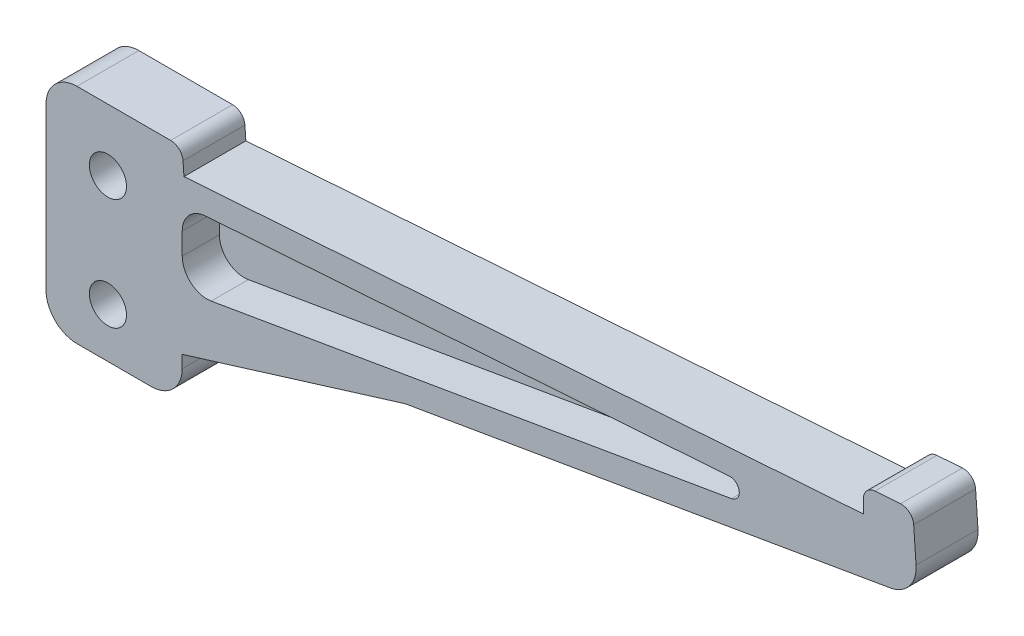
ISO-10303-21;
HEADER;
FILE_DESCRIPTION(('STEP AP214'),'2;1');
FILE_NAME('part.step','',(''),(''),'','','');
FILE_SCHEMA(('AUTOMOTIVE_DESIGN { 1 0 10303 214 1 1 1 1 }'));
ENDSEC;
DATA;
#1=APPLICATION_CONTEXT('core data for automotive mechanical design processes');
#2=APPLICATION_PROTOCOL_DEFINITION('international standard','automotive_design',2000,#1);
#3=PRODUCT_CONTEXT('',#1,'mechanical');
#4=PRODUCT('Part','Part','',(#3));
#5=PRODUCT_RELATED_PRODUCT_CATEGORY('part','',(#4));
#6=PRODUCT_DEFINITION_FORMATION('','',#4);
#7=PRODUCT_DEFINITION_CONTEXT('part definition',#1,'design');
#8=PRODUCT_DEFINITION('design','',#6,#7);
#9=PRODUCT_DEFINITION_SHAPE('','',#8);
#10=(LENGTH_UNIT() NAMED_UNIT(*) SI_UNIT(.MILLI.,.METRE.));
#11=(NAMED_UNIT(*) PLANE_ANGLE_UNIT() SI_UNIT($,.RADIAN.));
#12=(NAMED_UNIT(*) SI_UNIT($,.STERADIAN.) SOLID_ANGLE_UNIT());
#13=UNCERTAINTY_MEASURE_WITH_UNIT(LENGTH_MEASURE(1.E-05),#10,'distance_accuracy_value','');
#14=(GEOMETRIC_REPRESENTATION_CONTEXT(3) GLOBAL_UNCERTAINTY_ASSIGNED_CONTEXT((#13)) GLOBAL_UNIT_ASSIGNED_CONTEXT((#10,
#11,#12)) REPRESENTATION_CONTEXT('',''));
#15=CARTESIAN_POINT('',(0.,0.,0.));
#16=DIRECTION('',(0.,0.,1.));
#17=DIRECTION('',(1.,0.,0.));
#18=AXIS2_PLACEMENT_3D('',#15,#16,#17);
#19=CARTESIAN_POINT('',(124.011071423557,15.8276933308639,10.));
#20=DIRECTION('',(0.,0.,-1.));
#21=DIRECTION('',(-1.,0.,0.));
#22=AXIS2_PLACEMENT_3D('',#19,#20,#21);
#23=PLANE('',#22);
#24=DIRECTION('',(0.,1.,0.));
#25=VECTOR('',#24,1.);
#26=CARTESIAN_POINT('',(12.,-21.,10.));
#27=LINE('',#26,#25);
#28=CARTESIAN_POINT('',(12.,-21.,10.));
#29=VERTEX_POINT('',#28);
#30=CARTESIAN_POINT('',(12.,-18.9902562010393,10.));
#31=VERTEX_POINT('',#30);
#32=EDGE_CURVE('E209',#29,#31,#27,.T.);
#33=ORIENTED_EDGE('',*,*,#32,.T.);
#34=DIRECTION('',(0.955656131445848,0.294484903568854,0.));
#35=VECTOR('',#34,1.);
#36=CARTESIAN_POINT('',(12.,-18.9902562010393,10.));
#37=LINE('',#36,#35);
#38=CARTESIAN_POINT('',(48.,-7.8968762920553,10.));
#39=VERTEX_POINT('',#38);
#40=EDGE_CURVE('E196',#31,#39,#37,.T.);
#41=ORIENTED_EDGE('',*,*,#40,.T.);
#42=DIRECTION('',(0.985666446524818,0.168705827389386,0.));
#43=VECTOR('',#42,1.);
#44=CARTESIAN_POINT('',(12.,-14.0586055539481,10.));
#45=LINE('',#44,#43);
#46=CARTESIAN_POINT('',(126.368737699881,5.51664993858247,10.));
#47=VERTEX_POINT('',#46);
#48=EDGE_CURVE('E206',#39,#47,#45,.T.);
#49=ORIENTED_EDGE('',*,*,#48,.T.);
#50=CARTESIAN_POINT('',(125.525208562934,10.4449821712066,10.));
#51=DIRECTION('',(0.,0.,1.));
#52=DIRECTION('',(-1.,0.,0.));
#53=AXIS2_PLACEMENT_3D('',#50,#51,#52);
#54=CIRCLE('',#53,4.99999999999998);
#55=CARTESIAN_POINT('',(130.513028814233,10.7937645399272,10.));
#56=VERTEX_POINT('',#55);
#57=EDGE_CURVE('E215',#47,#56,#54,.T.);
#58=ORIENTED_EDGE('',*,*,#57,.T.);
#59=DIRECTION('',(-0.0697564737441267,0.997564050259824,0.));
#60=VECTOR('',#59,1.);
#61=CARTESIAN_POINT('',(130.131096773124,16.2556471925726,10.));
#62=LINE('',#61,#60);
#63=CARTESIAN_POINT('',(130.131096773124,16.2556471925726,10.));
#64=VERTEX_POINT('',#63);
#65=EDGE_CURVE('E217',#56,#64,#62,.T.);
#66=ORIENTED_EDGE('',*,*,#65,.T.);
#67=CARTESIAN_POINT('',(128.135968672604,16.1161342450843,10.));
#68=DIRECTION('',(0.,0.,1.));
#69=DIRECTION('',(-1.,0.,0.));
#70=AXIS2_PLACEMENT_3D('',#67,#68,#69);
#71=CIRCLE('',#70,1.99999999999999);
#72=CARTESIAN_POINT('',(127.996455725116,18.111262345604,10.));
#73=VERTEX_POINT('',#72);
#74=EDGE_CURVE('E224',#64,#73,#71,.T.);
#75=ORIENTED_EDGE('',*,*,#74,.T.);
#76=DIRECTION('',(-0.997564050259824,-0.0697564737441257,0.));
#77=VECTOR('',#76,1.);
#78=CARTESIAN_POINT('',(123.871558476069,17.8228214313835,10.));
#79=LINE('',#78,#77);
#80=CARTESIAN_POINT('',(123.871558476069,17.8228214313835,10.));
#81=VERTEX_POINT('',#80);
#82=EDGE_CURVE('E226',#73,#81,#79,.T.);
#83=ORIENTED_EDGE('',*,*,#82,.T.);
#84=CARTESIAN_POINT('',(124.011071423557,15.8276933308639,10.));
#85=DIRECTION('',(0.,0.,1.));
#86=DIRECTION('',(-1.,0.,0.));
#87=AXIS2_PLACEMENT_3D('',#84,#85,#86);
#88=CIRCLE('',#87,2.);
#89=CARTESIAN_POINT('',(122.011071423557,15.8276933308639,10.));
#90=VERTEX_POINT('',#89);
#91=EDGE_CURVE('E228',#81,#90,#88,.T.);
#92=ORIENTED_EDGE('',*,*,#91,.T.);
#93=DIRECTION('',(0.,-1.,0.));
#94=VECTOR('',#93,1.);
#95=CARTESIAN_POINT('',(122.011071423557,13.6829559108145,10.));
#96=LINE('',#95,#94);
#97=CARTESIAN_POINT('',(122.011071423557,13.6829559108145,10.));
#98=VERTEX_POINT('',#97);
#99=EDGE_CURVE('E230',#90,#98,#96,.T.);
#100=ORIENTED_EDGE('',*,*,#99,.T.);
#101=DIRECTION('',(-0.997564050259824,-0.0697564737441256,0.));
#102=VECTOR('',#101,1.);
#103=CARTESIAN_POINT('',(12.2790258949765,6.0097437989607,10.));
#104=LINE('',#103,#102);
#105=CARTESIAN_POINT('',(12.2790258949765,6.0097437989607,10.));
#106=VERTEX_POINT('',#105);
#107=EDGE_CURVE('E270',#98,#106,#104,.T.);
#108=ORIENTED_EDGE('',*,*,#107,.T.);
#109=DIRECTION('',(-0.0697564737441258,0.997564050259824,0.));
#110=VECTOR('',#109,1.);
#111=CARTESIAN_POINT('',(12.1300979282443,8.13951294748825,10.));
#112=LINE('',#111,#110);
#113=CARTESIAN_POINT('',(12.1300979282443,8.13951294748825,10.));
#114=VERTEX_POINT('',#113);
#115=EDGE_CURVE('E417',#106,#114,#112,.T.);
#116=ORIENTED_EDGE('',*,*,#115,.T.);
#117=CARTESIAN_POINT('',(10.1349698277247,8.,10.));
#118=DIRECTION('',(0.,0.,1.));
#119=DIRECTION('',(-1.,0.,0.));
#120=AXIS2_PLACEMENT_3D('',#117,#118,#119);
#121=CIRCLE('',#120,2.);
#122=CARTESIAN_POINT('',(10.1349698277247,10.,10.));
#123=VERTEX_POINT('',#122);
#124=EDGE_CURVE('E316',#114,#123,#121,.T.);
#125=ORIENTED_EDGE('',*,*,#124,.T.);
#126=DIRECTION('',(-1.,0.,0.));
#127=VECTOR('',#126,1.);
#128=CARTESIAN_POINT('',(-4.99999999999996,10.,10.));
#129=LINE('',#128,#127);
#130=CARTESIAN_POINT('',(-4.99999999999996,10.,10.));
#131=VERTEX_POINT('',#130);
#132=EDGE_CURVE('E336',#123,#131,#129,.T.);
#133=ORIENTED_EDGE('',*,*,#132,.T.);
#134=CARTESIAN_POINT('',(-5.,5.,10.));
#135=DIRECTION('',(0.,0.,1.));
#136=DIRECTION('',(1.,0.,0.));
#137=AXIS2_PLACEMENT_3D('',#134,#135,#136);
#138=CIRCLE('',#137,5.);
#139=CARTESIAN_POINT('',(-10.,4.99999999999996,10.));
#140=VERTEX_POINT('',#139);
#141=EDGE_CURVE('E333',#131,#140,#138,.T.);
#142=ORIENTED_EDGE('',*,*,#141,.T.);
#143=DIRECTION('',(0.,-1.,0.));
#144=VECTOR('',#143,1.);
#145=CARTESIAN_POINT('',(-9.99999999999999,-21.,10.));
#146=LINE('',#145,#144);
#147=CARTESIAN_POINT('',(-9.99999999999999,-21.,10.));
#148=VERTEX_POINT('',#147);
#149=EDGE_CURVE('E335',#140,#148,#146,.T.);
#150=ORIENTED_EDGE('',*,*,#149,.T.);
#151=CARTESIAN_POINT('',(-4.99999999999999,-21.,10.));
#152=DIRECTION('',(0.,0.,1.));
#153=DIRECTION('',(-1.,0.,0.));
#154=AXIS2_PLACEMENT_3D('',#151,#152,#153);
#155=CIRCLE('',#154,5.);
#156=CARTESIAN_POINT('',(-4.99999999999999,-26.,10.));
#157=VERTEX_POINT('',#156);
#158=EDGE_CURVE('E338',#148,#157,#155,.T.);
#159=ORIENTED_EDGE('',*,*,#158,.T.);
#160=DIRECTION('',(1.,0.,0.));
#161=VECTOR('',#160,1.);
#162=CARTESIAN_POINT('',(7.,-26.,10.));
#163=LINE('',#162,#161);
#164=CARTESIAN_POINT('',(7.,-26.,10.));
#165=VERTEX_POINT('',#164);
#166=EDGE_CURVE('E344',#157,#165,#163,.T.);
#167=ORIENTED_EDGE('',*,*,#166,.T.);
#168=CARTESIAN_POINT('',(7.,-21.,10.));
#169=DIRECTION('',(0.,0.,1.));
#170=DIRECTION('',(-1.,0.,0.));
#171=AXIS2_PLACEMENT_3D('',#168,#169,#170);
#172=CIRCLE('',#171,5.);
#173=EDGE_CURVE('E219',#165,#29,#172,.T.);
#174=ORIENTED_EDGE('',*,*,#173,.T.);
#175=EDGE_LOOP('',(#33,#41,#49,#58,#66,#75,#83,#92,#100,#108,#116,#125,#133,#142,#150,#159,#167,#174));
#176=FACE_BOUND('',#175,.T.);
#177=CARTESIAN_POINT('',(100.464092384595,6.66281392015979,10.));
#178=DIRECTION('',(0.,0.,1.));
#179=DIRECTION('',(1.,0.,0.));
#180=AXIS2_PLACEMENT_3D('',#177,#178,#179);
#181=CIRCLE('',#180,1.5);
#182=CARTESIAN_POINT('',(100.717151125679,5.18431425037256,10.));
#183=VERTEX_POINT('',#182);
#184=CARTESIAN_POINT('',(100.359457673978,8.15915999554953,10.));
#185=VERTEX_POINT('',#184);
#186=EDGE_CURVE('E370',#183,#185,#181,.T.);
#187=ORIENTED_EDGE('',*,*,#186,.F.);
#188=DIRECTION('',(0.985666446524818,0.168705827389386,0.));
#189=VECTOR('',#188,1.);
#190=CARTESIAN_POINT('',(16.6748233095575,-9.20029882024365,10.));
#191=LINE('',#190,#189);
#192=CARTESIAN_POINT('',(16.6748233095575,-9.20029882024365,10.));
#193=VERTEX_POINT('',#192);
#194=EDGE_CURVE('E358',#193,#183,#191,.T.);
#195=ORIENTED_EDGE('',*,*,#194,.F.);
#196=CARTESIAN_POINT('',(16.,-5.25763303414438,10.));
#197=DIRECTION('',(0.,0.,1.));
#198=DIRECTION('',(-1.,0.,0.));
#199=AXIS2_PLACEMENT_3D('',#196,#197,#198);
#200=CIRCLE('',#199,4.);
#201=CARTESIAN_POINT('',(12.,-5.25763303414438,9.99999999999999));
#202=VERTEX_POINT('',#201);
#203=EDGE_CURVE('E355',#202,#193,#200,.T.);
#204=ORIENTED_EDGE('',*,*,#203,.F.);
#205=DIRECTION('',(0.,-1.,0.));
#206=VECTOR('',#205,1.);
#207=CARTESIAN_POINT('',(12.,-5.25763303414438,10.));
#208=LINE('',#207,#206);
#209=CARTESIAN_POINT('',(12.,-1.74959552920002,10.));
#210=VERTEX_POINT('',#209);
#211=EDGE_CURVE('E57',#210,#202,#208,.T.);
#212=ORIENTED_EDGE('',*,*,#211,.F.);
#213=CARTESIAN_POINT('',(16.,-1.74959552920002,10.));
#214=DIRECTION('',(0.,0.,1.));
#215=DIRECTION('',(-1.,0.,0.));
#216=AXIS2_PLACEMENT_3D('',#213,#214,#215);
#217=CIRCLE('',#216,4.);
#218=CARTESIAN_POINT('',(15.7209741050235,2.24066067183928,10.));
#219=VERTEX_POINT('',#218);
#220=EDGE_CURVE('E364',#219,#210,#217,.T.);
#221=ORIENTED_EDGE('',*,*,#220,.F.);
#222=DIRECTION('',(-0.997564050259824,-0.0697564737441258,0.));
#223=VECTOR('',#222,1.);
#224=CARTESIAN_POINT('',(15.7209741050235,2.24066067183928,10.));
#225=LINE('',#224,#223);
#226=EDGE_CURVE('E367',#185,#219,#225,.T.);
#227=ORIENTED_EDGE('',*,*,#226,.F.);
#228=EDGE_LOOP('',(#187,#195,#204,#212,#221,#227));
#229=FACE_BOUND('',#228,.T.);
#230=CARTESIAN_POINT('',(0.,0.,10.));
#231=DIRECTION('',(0.,0.,1.));
#232=DIRECTION('',(1.,0.,0.));
#233=AXIS2_PLACEMENT_3D('',#230,#231,#232);
#234=CIRCLE('',#233,3.);
#235=CARTESIAN_POINT('',(3.,0.,10.));
#236=VERTEX_POINT('',#235);
#237=EDGE_CURVE('E237',#236,#236,#234,.T.);
#238=ORIENTED_EDGE('',*,*,#237,.F.);
#239=EDGE_LOOP('',(#238));
#240=FACE_BOUND('',#239,.T.);
#241=CARTESIAN_POINT('',(0.,-18.,10.));
#242=DIRECTION('',(0.,0.,1.));
#243=DIRECTION('',(1.,0.,0.));
#244=AXIS2_PLACEMENT_3D('',#241,#242,#243);
#245=CIRCLE('',#244,3.);
#246=CARTESIAN_POINT('',(3.,-18.,10.));
#247=VERTEX_POINT('',#246);
#248=EDGE_CURVE('E405',#247,#247,#245,.T.);
#249=ORIENTED_EDGE('',*,*,#248,.F.);
#250=EDGE_LOOP('',(#249));
#251=FACE_BOUND('',#250,.T.);
#252=ADVANCED_FACE('F34',(#176,#229,#240,#251),#23,.F.);
#253=CARTESIAN_POINT('',(124.011071423557,15.8276933308639,0.));
#254=DIRECTION('',(0.,0.,-1.));
#255=DIRECTION('',(-1.,0.,0.));
#256=AXIS2_PLACEMENT_3D('',#253,#254,#255);
#257=PLANE('',#256);
#258=DIRECTION('',(0.955656131445847,0.294484903568854,0.));
#259=VECTOR('',#258,1.);
#260=CARTESIAN_POINT('',(12.,-18.9902562010393,0.));
#261=LINE('',#260,#259);
#262=CARTESIAN_POINT('',(12.,-18.9902562010393,0.));
#263=VERTEX_POINT('',#262);
#264=CARTESIAN_POINT('',(48.,-7.8968762920553,0.));
#265=VERTEX_POINT('',#264);
#266=EDGE_CURVE('E49',#263,#265,#261,.T.);
#267=ORIENTED_EDGE('',*,*,#266,.F.);
#268=DIRECTION('',(0.,1.,0.));
#269=VECTOR('',#268,1.);
#270=CARTESIAN_POINT('',(12.,-21.,0.));
#271=LINE('',#270,#269);
#272=CARTESIAN_POINT('',(12.,-21.,0.));
#273=VERTEX_POINT('',#272);
#274=EDGE_CURVE('E253',#273,#263,#271,.T.);
#275=ORIENTED_EDGE('',*,*,#274,.F.);
#276=CARTESIAN_POINT('',(7.,-21.,0.));
#277=DIRECTION('',(0.,0.,1.));
#278=DIRECTION('',(-1.,0.,0.));
#279=AXIS2_PLACEMENT_3D('',#276,#277,#278);
#280=CIRCLE('',#279,5.);
#281=CARTESIAN_POINT('',(7.,-26.,0.));
#282=VERTEX_POINT('',#281);
#283=EDGE_CURVE('E251',#282,#273,#280,.T.);
#284=ORIENTED_EDGE('',*,*,#283,.F.);
#285=DIRECTION('',(1.,0.,0.));
#286=VECTOR('',#285,1.);
#287=CARTESIAN_POINT('',(7.,-26.,0.));
#288=LINE('',#287,#286);
#289=CARTESIAN_POINT('',(-4.99999999999999,-26.,0.));
#290=VERTEX_POINT('',#289);
#291=EDGE_CURVE('E249',#290,#282,#288,.T.);
#292=ORIENTED_EDGE('',*,*,#291,.F.);
#293=CARTESIAN_POINT('',(-4.99999999999999,-21.,0.));
#294=DIRECTION('',(0.,0.,1.));
#295=DIRECTION('',(-1.,0.,0.));
#296=AXIS2_PLACEMENT_3D('',#293,#294,#295);
#297=CIRCLE('',#296,5.);
#298=CARTESIAN_POINT('',(-9.99999999999999,-21.,0.));
#299=VERTEX_POINT('',#298);
#300=EDGE_CURVE('E247',#299,#290,#297,.T.);
#301=ORIENTED_EDGE('',*,*,#300,.F.);
#302=DIRECTION('',(0.,-1.,0.));
#303=VECTOR('',#302,1.);
#304=CARTESIAN_POINT('',(-9.99999999999999,-21.,0.));
#305=LINE('',#304,#303);
#306=CARTESIAN_POINT('',(-10.,4.99999999999996,0.));
#307=VERTEX_POINT('',#306);
#308=EDGE_CURVE('E245',#307,#299,#305,.T.);
#309=ORIENTED_EDGE('',*,*,#308,.F.);
#310=CARTESIAN_POINT('',(-5.,5.,0.));
#311=DIRECTION('',(0.,0.,1.));
#312=DIRECTION('',(1.,0.,0.));
#313=AXIS2_PLACEMENT_3D('',#310,#311,#312);
#314=CIRCLE('',#313,5.);
#315=CARTESIAN_POINT('',(-4.99999999999996,10.,0.));
#316=VERTEX_POINT('',#315);
#317=EDGE_CURVE('E243',#316,#307,#314,.T.);
#318=ORIENTED_EDGE('',*,*,#317,.F.);
#319=DIRECTION('',(-1.,0.,0.));
#320=VECTOR('',#319,1.);
#321=CARTESIAN_POINT('',(-4.99999999999996,10.,0.));
#322=LINE('',#321,#320);
#323=CARTESIAN_POINT('',(10.1349698277247,10.,0.));
#324=VERTEX_POINT('',#323);
#325=EDGE_CURVE('E241',#324,#316,#322,.T.);
#326=ORIENTED_EDGE('',*,*,#325,.F.);
#327=CARTESIAN_POINT('',(10.1349698277247,8.,0.));
#328=DIRECTION('',(0.,0.,1.));
#329=DIRECTION('',(-1.,0.,0.));
#330=AXIS2_PLACEMENT_3D('',#327,#328,#329);
#331=CIRCLE('',#330,2.);
#332=CARTESIAN_POINT('',(12.1300979282443,8.13951294748825,0.));
#333=VERTEX_POINT('',#332);
#334=EDGE_CURVE('E239',#333,#324,#331,.T.);
#335=ORIENTED_EDGE('',*,*,#334,.F.);
#336=DIRECTION('',(-0.0697564737441258,0.997564050259824,0.));
#337=VECTOR('',#336,1.);
#338=CARTESIAN_POINT('',(12.1300979282443,8.13951294748825,0.));
#339=LINE('',#338,#337);
#340=CARTESIAN_POINT('',(12.2790258949765,6.0097437989607,0.));
#341=VERTEX_POINT('',#340);
#342=EDGE_CURVE('E236',#341,#333,#339,.T.);
#343=ORIENTED_EDGE('',*,*,#342,.F.);
#344=DIRECTION('',(-0.997564050259824,-0.0697564737441256,0.));
#345=VECTOR('',#344,1.);
#346=CARTESIAN_POINT('',(12.2790258949765,6.0097437989607,0.));
#347=LINE('',#346,#345);
#348=CARTESIAN_POINT('',(122.011071423557,13.6829559108145,0.));
#349=VERTEX_POINT('',#348);
#350=EDGE_CURVE('E233',#349,#341,#347,.T.);
#351=ORIENTED_EDGE('',*,*,#350,.F.);
#352=DIRECTION('',(0.,-1.,0.));
#353=VECTOR('',#352,1.);
#354=CARTESIAN_POINT('',(122.011071423557,13.6829559108145,0.));
#355=LINE('',#354,#353);
#356=CARTESIAN_POINT('',(122.011071423557,15.8276933308639,0.));
#357=VERTEX_POINT('',#356);
#358=EDGE_CURVE('E268',#357,#349,#355,.T.);
#359=ORIENTED_EDGE('',*,*,#358,.F.);
#360=CARTESIAN_POINT('',(124.011071423557,15.8276933308639,0.));
#361=DIRECTION('',(0.,0.,1.));
#362=DIRECTION('',(-1.,0.,0.));
#363=AXIS2_PLACEMENT_3D('',#360,#361,#362);
#364=CIRCLE('',#363,2.);
#365=CARTESIAN_POINT('',(123.871558476069,17.8228214313835,0.));
#366=VERTEX_POINT('',#365);
#367=EDGE_CURVE('E266',#366,#357,#364,.T.);
#368=ORIENTED_EDGE('',*,*,#367,.F.);
#369=DIRECTION('',(-0.997564050259824,-0.0697564737441257,0.));
#370=VECTOR('',#369,1.);
#371=CARTESIAN_POINT('',(123.871558476069,17.8228214313835,0.));
#372=LINE('',#371,#370);
#373=CARTESIAN_POINT('',(127.996455725116,18.111262345604,0.));
#374=VERTEX_POINT('',#373);
#375=EDGE_CURVE('E264',#374,#366,#372,.T.);
#376=ORIENTED_EDGE('',*,*,#375,.F.);
#377=CARTESIAN_POINT('',(128.135968672604,16.1161342450843,0.));
#378=DIRECTION('',(0.,0.,1.));
#379=DIRECTION('',(-1.,0.,0.));
#380=AXIS2_PLACEMENT_3D('',#377,#378,#379);
#381=CIRCLE('',#380,1.99999999999999);
#382=CARTESIAN_POINT('',(130.131096773124,16.2556471925726,0.));
#383=VERTEX_POINT('',#382);
#384=EDGE_CURVE('E262',#383,#374,#381,.T.);
#385=ORIENTED_EDGE('',*,*,#384,.F.);
#386=DIRECTION('',(-0.0697564737441267,0.997564050259824,0.));
#387=VECTOR('',#386,1.);
#388=CARTESIAN_POINT('',(130.131096773124,16.2556471925726,0.));
#389=LINE('',#388,#387);
#390=CARTESIAN_POINT('',(130.513028814233,10.7937645399272,0.));
#391=VERTEX_POINT('',#390);
#392=EDGE_CURVE('E260',#391,#383,#389,.T.);
#393=ORIENTED_EDGE('',*,*,#392,.F.);
#394=CARTESIAN_POINT('',(125.525208562934,10.4449821712066,0.));
#395=DIRECTION('',(0.,0.,1.));
#396=DIRECTION('',(-1.,0.,0.));
#397=AXIS2_PLACEMENT_3D('',#394,#395,#396);
#398=CIRCLE('',#397,4.99999999999998);
#399=CARTESIAN_POINT('',(126.368737699881,5.51664993858247,0.));
#400=VERTEX_POINT('',#399);
#401=EDGE_CURVE('E258',#400,#391,#398,.T.);
#402=ORIENTED_EDGE('',*,*,#401,.F.);
#403=DIRECTION('',(0.985666446524818,0.168705827389386,0.));
#404=VECTOR('',#403,1.);
#405=CARTESIAN_POINT('',(12.,-14.0586055539481,0.));
#406=LINE('',#405,#404);
#407=EDGE_CURVE('E256',#265,#400,#406,.T.);
#408=ORIENTED_EDGE('',*,*,#407,.F.);
#409=EDGE_LOOP('',(#267,#275,#284,#292,#301,#309,#318,#326,#335,#343,#351,#359,#368,#376,#385,
#393,#402,#408));
#410=FACE_BOUND('',#409,.T.);
#411=CARTESIAN_POINT('',(0.,0.,0.));
#412=DIRECTION('',(0.,0.,1.));
#413=DIRECTION('',(1.,0.,0.));
#414=AXIS2_PLACEMENT_3D('',#411,#412,#413);
#415=CIRCLE('',#414,3.);
#416=CARTESIAN_POINT('',(3.,0.,0.));
#417=VERTEX_POINT('',#416);
#418=EDGE_CURVE('E408',#417,#417,#415,.T.);
#419=ORIENTED_EDGE('',*,*,#418,.T.);
#420=EDGE_LOOP('',(#419));
#421=FACE_BOUND('',#420,.T.);
#422=CARTESIAN_POINT('',(0.,-18.,0.));
#423=DIRECTION('',(0.,0.,1.));
#424=DIRECTION('',(1.,0.,0.));
#425=AXIS2_PLACEMENT_3D('',#422,#423,#424);
#426=CIRCLE('',#425,3.);
#427=CARTESIAN_POINT('',(3.,-18.,0.));
#428=VERTEX_POINT('',#427);
#429=EDGE_CURVE('E404',#428,#428,#426,.T.);
#430=ORIENTED_EDGE('',*,*,#429,.T.);
#431=EDGE_LOOP('',(#430));
#432=FACE_BOUND('',#431,.T.);
#433=ADVANCED_FACE('F320',(#410,#421,#432),#257,.T.);
#434=CARTESIAN_POINT('',(12.2790258949765,6.0097437989607,10.));
#435=DIRECTION('',(0.0697564737441256,-0.997564050259824,0.));
#436=DIRECTION('',(0.997564050259824,0.0697564737441256,0.));
#437=AXIS2_PLACEMENT_3D('',#434,#435,#436);
#438=PLANE('',#437);
#439=ORIENTED_EDGE('',*,*,#350,.T.);
#440=DIRECTION('',(0.,0.,-1.));
#441=VECTOR('',#440,1.);
#442=CARTESIAN_POINT('',(12.2790258949765,6.0097437989607,10.));
#443=LINE('',#442,#441);
#444=EDGE_CURVE('E12',#106,#341,#443,.T.);
#445=ORIENTED_EDGE('',*,*,#444,.F.);
#446=ORIENTED_EDGE('',*,*,#107,.F.);
#447=DIRECTION('',(0.,0.,-1.));
#448=VECTOR('',#447,1.);
#449=CARTESIAN_POINT('',(122.011071423557,13.6829559108145,10.));
#450=LINE('',#449,#448);
#451=EDGE_CURVE('E232',#98,#349,#450,.T.);
#452=ORIENTED_EDGE('',*,*,#451,.T.);
#453=EDGE_LOOP('',(#439,#445,#446,#452));
#454=FACE_BOUND('',#453,.T.);
#455=ADVANCED_FACE('F36',(#454),#438,.F.);
#456=CARTESIAN_POINT('',(12.1300979282443,8.13951294748825,10.));
#457=DIRECTION('',(-0.997564050259824,-0.0697564737441258,0.));
#458=DIRECTION('',(0.0697564737441258,-0.997564050259824,0.));
#459=AXIS2_PLACEMENT_3D('',#456,#457,#458);
#460=PLANE('',#459);
#461=ORIENTED_EDGE('',*,*,#342,.T.);
#462=DIRECTION('',(0.,0.,-1.));
#463=VECTOR('',#462,1.);
#464=CARTESIAN_POINT('',(12.1300979282443,8.13951294748825,10.));
#465=LINE('',#464,#463);
#466=EDGE_CURVE('E42',#114,#333,#465,.T.);
#467=ORIENTED_EDGE('',*,*,#466,.F.);
#468=ORIENTED_EDGE('',*,*,#115,.F.);
#469=ORIENTED_EDGE('',*,*,#444,.T.);
#470=EDGE_LOOP('',(#461,#467,#468,#469));
#471=FACE_BOUND('',#470,.T.);
#472=ADVANCED_FACE('F420',(#471),#460,.F.);
#473=CARTESIAN_POINT('',(10.1349698277247,8.,10.));
#474=DIRECTION('',(0.,0.,-1.));
#475=DIRECTION('',(-1.,0.,0.));
#476=AXIS2_PLACEMENT_3D('',#473,#474,#475);
#477=CYLINDRICAL_SURFACE('',#476,2.);
#478=ORIENTED_EDGE('',*,*,#334,.T.);
#479=DIRECTION('',(0.,0.,-1.));
#480=VECTOR('',#479,1.);
#481=CARTESIAN_POINT('',(10.1349698277247,10.,10.));
#482=LINE('',#481,#480);
#483=EDGE_CURVE('E307',#123,#324,#482,.T.);
#484=ORIENTED_EDGE('',*,*,#483,.F.);
#485=ORIENTED_EDGE('',*,*,#124,.F.);
#486=ORIENTED_EDGE('',*,*,#466,.T.);
#487=EDGE_LOOP('',(#478,#484,#485,#486));
#488=FACE_BOUND('',#487,.T.);
#489=ADVANCED_FACE('F314',(#488),#477,.T.);
#490=CARTESIAN_POINT('',(-4.99999999999996,10.,10.));
#491=DIRECTION('',(0.,-1.,0.));
#492=DIRECTION('',(1.,0.,0.));
#493=AXIS2_PLACEMENT_3D('',#490,#491,#492);
#494=PLANE('',#493);
#495=ORIENTED_EDGE('',*,*,#325,.T.);
#496=DIRECTION('',(0.,0.,-1.));
#497=VECTOR('',#496,1.);
#498=CARTESIAN_POINT('',(-4.99999999999996,10.,10.));
#499=LINE('',#498,#497);
#500=EDGE_CURVE('E304',#131,#316,#499,.T.);
#501=ORIENTED_EDGE('',*,*,#500,.F.);
#502=ORIENTED_EDGE('',*,*,#132,.F.);
#503=ORIENTED_EDGE('',*,*,#483,.T.);
#504=EDGE_LOOP('',(#495,#501,#502,#503));
#505=FACE_BOUND('',#504,.T.);
#506=ADVANCED_FACE('F327',(#505),#494,.F.);
#507=CARTESIAN_POINT('',(-5.,5.,10.));
#508=DIRECTION('',(0.,0.,-1.));
#509=DIRECTION('',(-1.,0.,0.));
#510=AXIS2_PLACEMENT_3D('',#507,#508,#509);
#511=CYLINDRICAL_SURFACE('',#510,5.);
#512=ORIENTED_EDGE('',*,*,#317,.T.);
#513=DIRECTION('',(0.,0.,-1.));
#514=VECTOR('',#513,1.);
#515=CARTESIAN_POINT('',(-10.,4.99999999999996,10.));
#516=LINE('',#515,#514);
#517=EDGE_CURVE('E301',#140,#307,#516,.T.);
#518=ORIENTED_EDGE('',*,*,#517,.F.);
#519=ORIENTED_EDGE('',*,*,#141,.F.);
#520=ORIENTED_EDGE('',*,*,#500,.T.);
#521=EDGE_LOOP('',(#512,#518,#519,#520));
#522=FACE_BOUND('',#521,.T.);
#523=ADVANCED_FACE('F331',(#522),#511,.T.);
#524=CARTESIAN_POINT('',(-9.99999999999999,-21.,10.));
#525=DIRECTION('',(1.,0.,0.));
#526=DIRECTION('',(0.,1.,0.));
#527=AXIS2_PLACEMENT_3D('',#524,#525,#526);
#528=PLANE('',#527);
#529=ORIENTED_EDGE('',*,*,#308,.T.);
#530=DIRECTION('',(0.,0.,-1.));
#531=VECTOR('',#530,1.);
#532=CARTESIAN_POINT('',(-9.99999999999999,-21.,10.));
#533=LINE('',#532,#531);
#534=EDGE_CURVE('E298',#148,#299,#533,.T.);
#535=ORIENTED_EDGE('',*,*,#534,.F.);
#536=ORIENTED_EDGE('',*,*,#149,.F.);
#537=ORIENTED_EDGE('',*,*,#517,.T.);
#538=EDGE_LOOP('',(#529,#535,#536,#537));
#539=FACE_BOUND('',#538,.T.);
#540=ADVANCED_FACE('F461',(#539),#528,.F.);
#541=CARTESIAN_POINT('',(-4.99999999999999,-21.,10.));
#542=DIRECTION('',(0.,0.,-1.));
#543=DIRECTION('',(-1.,0.,0.));
#544=AXIS2_PLACEMENT_3D('',#541,#542,#543);
#545=CYLINDRICAL_SURFACE('',#544,5.);
#546=ORIENTED_EDGE('',*,*,#300,.T.);
#547=DIRECTION('',(0.,0.,-1.));
#548=VECTOR('',#547,1.);
#549=CARTESIAN_POINT('',(-4.99999999999999,-26.,10.));
#550=LINE('',#549,#548);
#551=EDGE_CURVE('E295',#157,#290,#550,.T.);
#552=ORIENTED_EDGE('',*,*,#551,.F.);
#553=ORIENTED_EDGE('',*,*,#158,.F.);
#554=ORIENTED_EDGE('',*,*,#534,.T.);
#555=EDGE_LOOP('',(#546,#552,#553,#554));
#556=FACE_BOUND('',#555,.T.);
#557=ADVANCED_FACE('F458',(#556),#545,.T.);
#558=CARTESIAN_POINT('',(7.,-26.,10.));
#559=DIRECTION('',(0.,1.,0.));
#560=DIRECTION('',(0.,0.,1.));
#561=AXIS2_PLACEMENT_3D('',#558,#559,#560);
#562=PLANE('',#561);
#563=ORIENTED_EDGE('',*,*,#291,.T.);
#564=DIRECTION('',(0.,0.,-1.));
#565=VECTOR('',#564,1.);
#566=CARTESIAN_POINT('',(7.,-26.,10.));
#567=LINE('',#566,#565);
#568=EDGE_CURVE('E292',#165,#282,#567,.T.);
#569=ORIENTED_EDGE('',*,*,#568,.F.);
#570=ORIENTED_EDGE('',*,*,#166,.F.);
#571=ORIENTED_EDGE('',*,*,#551,.T.);
#572=EDGE_LOOP('',(#563,#569,#570,#571));
#573=FACE_BOUND('',#572,.T.);
#574=ADVANCED_FACE('F454',(#573),#562,.F.);
#575=CARTESIAN_POINT('',(7.,-21.,10.));
#576=DIRECTION('',(0.,0.,-1.));
#577=DIRECTION('',(-1.,0.,0.));
#578=AXIS2_PLACEMENT_3D('',#575,#576,#577);
#579=CYLINDRICAL_SURFACE('',#578,5.);
#580=ORIENTED_EDGE('',*,*,#283,.T.);
#581=DIRECTION('',(0.,0.,-1.));
#582=VECTOR('',#581,1.);
#583=CARTESIAN_POINT('',(12.,-21.,10.));
#584=LINE('',#583,#582);
#585=EDGE_CURVE('E289',#29,#273,#584,.T.);
#586=ORIENTED_EDGE('',*,*,#585,.F.);
#587=ORIENTED_EDGE('',*,*,#173,.F.);
#588=ORIENTED_EDGE('',*,*,#568,.T.);
#589=EDGE_LOOP('',(#580,#586,#587,#588));
#590=FACE_BOUND('',#589,.T.);
#591=ADVANCED_FACE('F350',(#590),#579,.T.);
#592=CARTESIAN_POINT('',(12.,-21.,10.));
#593=DIRECTION('',(-1.,0.,0.));
#594=DIRECTION('',(0.,-1.,0.));
#595=AXIS2_PLACEMENT_3D('',#592,#593,#594);
#596=PLANE('',#595);
#597=ORIENTED_EDGE('',*,*,#274,.T.);
#598=DIRECTION('',(0.,0.,1.));
#599=VECTOR('',#598,1.);
#600=CARTESIAN_POINT('',(12.,-18.9902562010393,-37.6704536448003));
#601=LINE('',#600,#599);
#602=EDGE_CURVE('E201',#263,#31,#601,.T.);
#603=ORIENTED_EDGE('',*,*,#602,.T.);
#604=ORIENTED_EDGE('',*,*,#32,.F.);
#605=ORIENTED_EDGE('',*,*,#585,.T.);
#606=EDGE_LOOP('',(#597,#603,#604,#605));
#607=FACE_BOUND('',#606,.T.);
#608=ADVANCED_FACE('F354',(#607),#596,.F.);
#609=CARTESIAN_POINT('',(12.,-14.0586055539481,10.));
#610=DIRECTION('',(-0.168705827389386,0.985666446524818,0.));
#611=DIRECTION('',(-0.985666446524818,-0.168705827389386,0.));
#612=AXIS2_PLACEMENT_3D('',#609,#610,#611);
#613=PLANE('',#612);
#614=ORIENTED_EDGE('',*,*,#48,.F.);
#615=DIRECTION('',(0.,0.,1.));
#616=VECTOR('',#615,1.);
#617=CARTESIAN_POINT('',(48.,-7.8968762920553,-37.6704536448003));
#618=LINE('',#617,#616);
#619=EDGE_CURVE('E193',#265,#39,#618,.T.);
#620=ORIENTED_EDGE('',*,*,#619,.F.);
#621=ORIENTED_EDGE('',*,*,#407,.T.);
#622=DIRECTION('',(0.,0.,-1.));
#623=VECTOR('',#622,1.);
#624=CARTESIAN_POINT('',(126.368737699881,5.51664993858247,10.));
#625=LINE('',#624,#623);
#626=EDGE_CURVE('E213',#47,#400,#625,.T.);
#627=ORIENTED_EDGE('',*,*,#626,.F.);
#628=EDGE_LOOP('',(#614,#620,#621,#627));
#629=FACE_BOUND('',#628,.T.);
#630=ADVANCED_FACE('F211',(#629),#613,.F.);
#631=CARTESIAN_POINT('',(125.525208562934,10.4449821712066,10.));
#632=DIRECTION('',(0.,0.,-1.));
#633=DIRECTION('',(-1.,0.,0.));
#634=AXIS2_PLACEMENT_3D('',#631,#632,#633);
#635=CYLINDRICAL_SURFACE('',#634,4.99999999999998);
#636=ORIENTED_EDGE('',*,*,#401,.T.);
#637=DIRECTION('',(0.,0.,-1.));
#638=VECTOR('',#637,1.);
#639=CARTESIAN_POINT('',(130.513028814233,10.7937645399272,10.));
#640=LINE('',#639,#638);
#641=EDGE_CURVE('E285',#56,#391,#640,.T.);
#642=ORIENTED_EDGE('',*,*,#641,.F.);
#643=ORIENTED_EDGE('',*,*,#57,.F.);
#644=ORIENTED_EDGE('',*,*,#626,.T.);
#645=EDGE_LOOP('',(#636,#642,#643,#644));
#646=FACE_BOUND('',#645,.T.);
#647=ADVANCED_FACE('F450',(#646),#635,.T.);
#648=CARTESIAN_POINT('',(130.131096773124,16.2556471925726,10.));
#649=DIRECTION('',(-0.997564050259824,-0.0697564737441267,0.));
#650=DIRECTION('',(0.0697564737441267,-0.997564050259824,0.));
#651=AXIS2_PLACEMENT_3D('',#648,#649,#650);
#652=PLANE('',#651);
#653=ORIENTED_EDGE('',*,*,#392,.T.);
#654=DIRECTION('',(0.,0.,-1.));
#655=VECTOR('',#654,1.);
#656=CARTESIAN_POINT('',(130.131096773124,16.2556471925726,10.));
#657=LINE('',#656,#655);
#658=EDGE_CURVE('E282',#64,#383,#657,.T.);
#659=ORIENTED_EDGE('',*,*,#658,.F.);
#660=ORIENTED_EDGE('',*,*,#65,.F.);
#661=ORIENTED_EDGE('',*,*,#641,.T.);
#662=EDGE_LOOP('',(#653,#659,#660,#661));
#663=FACE_BOUND('',#662,.T.);
#664=ADVANCED_FACE('F447',(#663),#652,.F.);
#665=CARTESIAN_POINT('',(128.135968672604,16.1161342450843,10.));
#666=DIRECTION('',(0.,0.,-1.));
#667=DIRECTION('',(-1.,0.,0.));
#668=AXIS2_PLACEMENT_3D('',#665,#666,#667);
#669=CYLINDRICAL_SURFACE('',#668,1.99999999999999);
#670=ORIENTED_EDGE('',*,*,#384,.T.);
#671=DIRECTION('',(0.,0.,-1.));
#672=VECTOR('',#671,1.);
#673=CARTESIAN_POINT('',(127.996455725116,18.111262345604,10.));
#674=LINE('',#673,#672);
#675=EDGE_CURVE('E279',#73,#374,#674,.T.);
#676=ORIENTED_EDGE('',*,*,#675,.F.);
#677=ORIENTED_EDGE('',*,*,#74,.F.);
#678=ORIENTED_EDGE('',*,*,#658,.T.);
#679=EDGE_LOOP('',(#670,#676,#677,#678));
#680=FACE_BOUND('',#679,.T.);
#681=ADVANCED_FACE('F442',(#680),#669,.T.);
#682=CARTESIAN_POINT('',(123.871558476069,17.8228214313835,10.));
#683=DIRECTION('',(0.0697564737441257,-0.997564050259824,0.));
#684=DIRECTION('',(0.997564050259824,0.0697564737441257,0.));
#685=AXIS2_PLACEMENT_3D('',#682,#683,#684);
#686=PLANE('',#685);
#687=ORIENTED_EDGE('',*,*,#375,.T.);
#688=DIRECTION('',(0.,0.,-1.));
#689=VECTOR('',#688,1.);
#690=CARTESIAN_POINT('',(123.871558476069,17.8228214313835,10.));
#691=LINE('',#690,#689);
#692=EDGE_CURVE('E276',#81,#366,#691,.T.);
#693=ORIENTED_EDGE('',*,*,#692,.F.);
#694=ORIENTED_EDGE('',*,*,#82,.F.);
#695=ORIENTED_EDGE('',*,*,#675,.T.);
#696=EDGE_LOOP('',(#687,#693,#694,#695));
#697=FACE_BOUND('',#696,.T.);
#698=ADVANCED_FACE('F436',(#697),#686,.F.);
#699=CARTESIAN_POINT('',(124.011071423557,15.8276933308639,10.));
#700=DIRECTION('',(0.,0.,-1.));
#701=DIRECTION('',(-1.,0.,0.));
#702=AXIS2_PLACEMENT_3D('',#699,#700,#701);
#703=CYLINDRICAL_SURFACE('',#702,2.);
#704=ORIENTED_EDGE('',*,*,#367,.T.);
#705=DIRECTION('',(0.,0.,-1.));
#706=VECTOR('',#705,1.);
#707=CARTESIAN_POINT('',(122.011071423557,15.8276933308639,10.));
#708=LINE('',#707,#706);
#709=EDGE_CURVE('E273',#90,#357,#708,.T.);
#710=ORIENTED_EDGE('',*,*,#709,.F.);
#711=ORIENTED_EDGE('',*,*,#91,.F.);
#712=ORIENTED_EDGE('',*,*,#692,.T.);
#713=EDGE_LOOP('',(#704,#710,#711,#712));
#714=FACE_BOUND('',#713,.T.);
#715=ADVANCED_FACE('F432',(#714),#703,.T.);
#716=CARTESIAN_POINT('',(122.011071423557,13.6829559108145,10.));
#717=DIRECTION('',(1.,0.,0.));
#718=DIRECTION('',(0.,0.,-1.));
#719=AXIS2_PLACEMENT_3D('',#716,#717,#718);
#720=PLANE('',#719);
#721=ORIENTED_EDGE('',*,*,#358,.T.);
#722=ORIENTED_EDGE('',*,*,#451,.F.);
#723=ORIENTED_EDGE('',*,*,#99,.F.);
#724=ORIENTED_EDGE('',*,*,#709,.T.);
#725=EDGE_LOOP('',(#721,#722,#723,#724));
#726=FACE_BOUND('',#725,.T.);
#727=ADVANCED_FACE('F427',(#726),#720,.F.);
#728=CARTESIAN_POINT('',(0.,0.,10.));
#729=DIRECTION('',(0.,0.,-1.));
#730=DIRECTION('',(-1.,0.,0.));
#731=AXIS2_PLACEMENT_3D('',#728,#729,#730);
#732=CYLINDRICAL_SURFACE('',#731,3.);
#733=ORIENTED_EDGE('',*,*,#237,.T.);
#734=EDGE_LOOP('',(#733));
#735=FACE_BOUND('',#734,.T.);
#736=ORIENTED_EDGE('',*,*,#418,.F.);
#737=EDGE_LOOP('',(#736));
#738=FACE_BOUND('',#737,.T.);
#739=ADVANCED_FACE('F477',(#735,#738),#732,.F.);
#740=CARTESIAN_POINT('',(0.,-18.,10.));
#741=DIRECTION('',(0.,0.,-1.));
#742=DIRECTION('',(-1.,0.,0.));
#743=AXIS2_PLACEMENT_3D('',#740,#741,#742);
#744=CYLINDRICAL_SURFACE('',#743,3.);
#745=ORIENTED_EDGE('',*,*,#248,.T.);
#746=EDGE_LOOP('',(#745));
#747=FACE_BOUND('',#746,.T.);
#748=ORIENTED_EDGE('',*,*,#429,.F.);
#749=EDGE_LOOP('',(#748));
#750=FACE_BOUND('',#749,.T.);
#751=ADVANCED_FACE('F547',(#747,#750),#744,.F.);
#752=CARTESIAN_POINT('',(124.011071423557,15.8276933308639,4.));
#753=DIRECTION('',(0.,0.,-1.));
#754=DIRECTION('',(-1.,0.,0.));
#755=AXIS2_PLACEMENT_3D('',#752,#753,#754);
#756=PLANE('',#755);
#757=CARTESIAN_POINT('',(16.,-5.25763303414438,4.));
#758=DIRECTION('',(0.,0.,-1.));
#759=DIRECTION('',(-1.,0.,0.));
#760=AXIS2_PLACEMENT_3D('',#757,#758,#759);
#761=CIRCLE('',#760,4.);
#762=CARTESIAN_POINT('',(12.,-5.25763303414438,4.));
#763=VERTEX_POINT('',#762);
#764=CARTESIAN_POINT('',(16.6748233095575,-9.20029882024365,4.));
#765=VERTEX_POINT('',#764);
#766=EDGE_CURVE('E378',#763,#765,#761,.F.);
#767=ORIENTED_EDGE('',*,*,#766,.T.);
#768=DIRECTION('',(0.985666446524818,0.168705827389386,0.));
#769=VECTOR('',#768,1.);
#770=CARTESIAN_POINT('',(16.6748233095575,-9.20029882024365,4.));
#771=LINE('',#770,#769);
#772=CARTESIAN_POINT('',(100.717151125679,5.18431425037256,4.));
#773=VERTEX_POINT('',#772);
#774=EDGE_CURVE('E363',#765,#773,#771,.T.);
#775=ORIENTED_EDGE('',*,*,#774,.T.);
#776=CARTESIAN_POINT('',(100.464092384595,6.66281392015979,4.));
#777=DIRECTION('',(0.,0.,-1.));
#778=DIRECTION('',(-1.,0.,0.));
#779=AXIS2_PLACEMENT_3D('',#776,#777,#778);
#780=CIRCLE('',#779,1.5);
#781=CARTESIAN_POINT('',(100.359457673978,8.15915999554953,4.));
#782=VERTEX_POINT('',#781);
#783=EDGE_CURVE('E395',#773,#782,#780,.F.);
#784=ORIENTED_EDGE('',*,*,#783,.T.);
#785=DIRECTION('',(-0.997564050259824,-0.0697564737441258,0.));
#786=VECTOR('',#785,1.);
#787=CARTESIAN_POINT('',(15.7209741050235,2.24066067183928,4.));
#788=LINE('',#787,#786);
#789=CARTESIAN_POINT('',(15.7209741050235,2.24066067183928,4.));
#790=VERTEX_POINT('',#789);
#791=EDGE_CURVE('E391',#782,#790,#788,.T.);
#792=ORIENTED_EDGE('',*,*,#791,.T.);
#793=CARTESIAN_POINT('',(16.,-1.74959552920002,4.));
#794=DIRECTION('',(0.,0.,-1.));
#795=DIRECTION('',(-1.,0.,0.));
#796=AXIS2_PLACEMENT_3D('',#793,#794,#795);
#797=CIRCLE('',#796,4.);
#798=CARTESIAN_POINT('',(12.,-1.74959552920002,4.));
#799=VERTEX_POINT('',#798);
#800=EDGE_CURVE('E387',#790,#799,#797,.F.);
#801=ORIENTED_EDGE('',*,*,#800,.T.);
#802=DIRECTION('',(0.,-1.,0.));
#803=VECTOR('',#802,1.);
#804=CARTESIAN_POINT('',(12.,-5.25763303414438,4.));
#805=LINE('',#804,#803);
#806=EDGE_CURVE('E383',#799,#763,#805,.T.);
#807=ORIENTED_EDGE('',*,*,#806,.T.);
#808=EDGE_LOOP('',(#767,#775,#784,#792,#801,#807));
#809=FACE_BOUND('',#808,.T.);
#810=ADVANCED_FACE('F554',(#809),#756,.F.);
#811=CARTESIAN_POINT('',(16.6748233095575,-9.20029882024365,-91.6352000634669));
#812=DIRECTION('',(0.168705827389386,-0.985666446524818,0.));
#813=DIRECTION('',(0.985666446524818,0.168705827389386,0.));
#814=AXIS2_PLACEMENT_3D('',#811,#812,#813);
#815=PLANE('',#814);
#816=DIRECTION('',(0.,0.,1.));
#817=VECTOR('',#816,1.);
#818=CARTESIAN_POINT('',(16.6748233095575,-9.20029882024365,-91.6352000634669));
#819=LINE('',#818,#817);
#820=EDGE_CURVE('E381',#765,#193,#819,.T.);
#821=ORIENTED_EDGE('',*,*,#820,.T.);
#822=ORIENTED_EDGE('',*,*,#194,.T.);
#823=DIRECTION('',(0.,0.,1.));
#824=VECTOR('',#823,1.);
#825=CARTESIAN_POINT('',(100.717151125679,5.18431425037256,-91.6352000634669));
#826=LINE('',#825,#824);
#827=EDGE_CURVE('E377',#773,#183,#826,.T.);
#828=ORIENTED_EDGE('',*,*,#827,.F.);
#829=ORIENTED_EDGE('',*,*,#774,.F.);
#830=EDGE_LOOP('',(#821,#822,#828,#829));
#831=FACE_BOUND('',#830,.T.);
#832=ADVANCED_FACE('F561',(#831),#815,.F.);
#833=CARTESIAN_POINT('',(100.464092384595,6.66281392015979,-91.6352000634669));
#834=DIRECTION('',(0.,0.,1.));
#835=DIRECTION('',(1.,0.,0.));
#836=AXIS2_PLACEMENT_3D('',#833,#834,#835);
#837=CYLINDRICAL_SURFACE('',#836,1.5);
#838=ORIENTED_EDGE('',*,*,#827,.T.);
#839=ORIENTED_EDGE('',*,*,#186,.T.);
#840=DIRECTION('',(0.,0.,1.));
#841=VECTOR('',#840,1.);
#842=CARTESIAN_POINT('',(100.359457673978,8.15915999554953,-91.6352000634669));
#843=LINE('',#842,#841);
#844=EDGE_CURVE('E394',#782,#185,#843,.T.);
#845=ORIENTED_EDGE('',*,*,#844,.F.);
#846=ORIENTED_EDGE('',*,*,#783,.F.);
#847=EDGE_LOOP('',(#838,#839,#845,#846));
#848=FACE_BOUND('',#847,.T.);
#849=ADVANCED_FACE('F569',(#848),#837,.F.);
#850=CARTESIAN_POINT('',(15.7209741050235,2.24066067183928,-91.6352000634669));
#851=DIRECTION('',(-0.0697564737441258,0.997564050259824,0.));
#852=DIRECTION('',(-0.997564050259824,-0.0697564737441258,0.));
#853=AXIS2_PLACEMENT_3D('',#850,#851,#852);
#854=PLANE('',#853);
#855=ORIENTED_EDGE('',*,*,#844,.T.);
#856=ORIENTED_EDGE('',*,*,#226,.T.);
#857=DIRECTION('',(0.,0.,1.));
#858=VECTOR('',#857,1.);
#859=CARTESIAN_POINT('',(15.7209741050235,2.24066067183928,-91.6352000634669));
#860=LINE('',#859,#858);
#861=EDGE_CURVE('E390',#790,#219,#860,.T.);
#862=ORIENTED_EDGE('',*,*,#861,.F.);
#863=ORIENTED_EDGE('',*,*,#791,.F.);
#864=EDGE_LOOP('',(#855,#856,#862,#863));
#865=FACE_BOUND('',#864,.T.);
#866=ADVANCED_FACE('F577',(#865),#854,.F.);
#867=CARTESIAN_POINT('',(16.,-1.74959552920002,-91.6352000634669));
#868=DIRECTION('',(0.,0.,1.));
#869=DIRECTION('',(1.,0.,0.));
#870=AXIS2_PLACEMENT_3D('',#867,#868,#869);
#871=CYLINDRICAL_SURFACE('',#870,4.);
#872=ORIENTED_EDGE('',*,*,#861,.T.);
#873=ORIENTED_EDGE('',*,*,#220,.T.);
#874=DIRECTION('',(0.,0.,1.));
#875=VECTOR('',#874,1.);
#876=CARTESIAN_POINT('',(12.,-1.74959552920002,-91.6352000634669));
#877=LINE('',#876,#875);
#878=EDGE_CURVE('E386',#799,#210,#877,.T.);
#879=ORIENTED_EDGE('',*,*,#878,.F.);
#880=ORIENTED_EDGE('',*,*,#800,.F.);
#881=EDGE_LOOP('',(#872,#873,#879,#880));
#882=FACE_BOUND('',#881,.T.);
#883=ADVANCED_FACE('F585',(#882),#871,.F.);
#884=CARTESIAN_POINT('',(12.,-5.25763303414438,-91.6352000634669));
#885=DIRECTION('',(-1.,0.,0.));
#886=DIRECTION('',(0.,0.,1.));
#887=AXIS2_PLACEMENT_3D('',#884,#885,#886);
#888=PLANE('',#887);
#889=ORIENTED_EDGE('',*,*,#878,.T.);
#890=ORIENTED_EDGE('',*,*,#211,.T.);
#891=DIRECTION('',(0.,0.,1.));
#892=VECTOR('',#891,1.);
#893=CARTESIAN_POINT('',(12.,-5.25763303414438,-91.6352000634669));
#894=LINE('',#893,#892);
#895=EDGE_CURVE('E382',#763,#202,#894,.T.);
#896=ORIENTED_EDGE('',*,*,#895,.F.);
#897=ORIENTED_EDGE('',*,*,#806,.F.);
#898=EDGE_LOOP('',(#889,#890,#896,#897));
#899=FACE_BOUND('',#898,.T.);
#900=ADVANCED_FACE('F593',(#899),#888,.F.);
#901=CARTESIAN_POINT('',(16.,-5.25763303414438,-91.6352000634669));
#902=DIRECTION('',(0.,0.,1.));
#903=DIRECTION('',(1.,0.,0.));
#904=AXIS2_PLACEMENT_3D('',#901,#902,#903);
#905=CYLINDRICAL_SURFACE('',#904,4.);
#906=ORIENTED_EDGE('',*,*,#895,.T.);
#907=ORIENTED_EDGE('',*,*,#203,.T.);
#908=ORIENTED_EDGE('',*,*,#820,.F.);
#909=ORIENTED_EDGE('',*,*,#766,.F.);
#910=EDGE_LOOP('',(#906,#907,#908,#909));
#911=FACE_BOUND('',#910,.T.);
#912=ADVANCED_FACE('F601',(#911),#905,.F.);
#913=CARTESIAN_POINT('',(12.,-18.9902562010393,-37.6704536448003));
#914=DIRECTION('',(0.294484903568854,-0.955656131445847,0.));
#915=DIRECTION('',(0.955656131445847,0.294484903568854,0.));
#916=AXIS2_PLACEMENT_3D('',#913,#914,#915);
#917=PLANE('',#916);
#918=ORIENTED_EDGE('',*,*,#602,.F.);
#919=ORIENTED_EDGE('',*,*,#266,.T.);
#920=ORIENTED_EDGE('',*,*,#619,.T.);
#921=ORIENTED_EDGE('',*,*,#40,.F.);
#922=EDGE_LOOP('',(#918,#919,#920,#921));
#923=FACE_BOUND('',#922,.T.);
#924=ADVANCED_FACE('F195',(#923),#917,.T.);
#925=CLOSED_SHELL('',(#252,#433,#455,#472,#489,#506,#523,#540,#557,#574,#591,#608,#630,#647,
#664,#681,#698,#715,#727,#739,#751,#810,#832,#849,#866,#883,#900,#912,#924));
#926=MANIFOLD_SOLID_BREP('B2',#925);
#927=ADVANCED_BREP_SHAPE_REPRESENTATION('',(#18,#926),#14);
#928=SHAPE_DEFINITION_REPRESENTATION(#9,#927);
ENDSEC;
END-ISO-10303-21;
